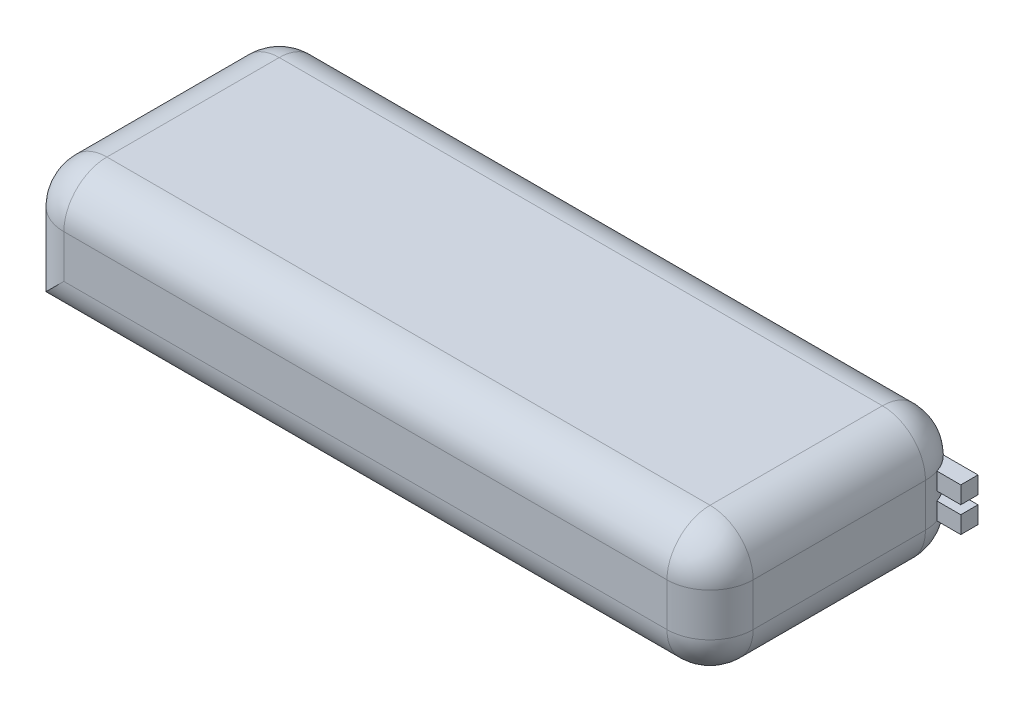
ISO-10303-21;
HEADER;
FILE_DESCRIPTION(('STEP AP214'),'2;1');
FILE_NAME('part.step','',(''),(''),'','','');
FILE_SCHEMA(('AUTOMOTIVE_DESIGN { 1 0 10303 214 1 1 1 1 }'));
ENDSEC;
DATA;
#1=APPLICATION_CONTEXT('core data for automotive mechanical design processes');
#2=APPLICATION_PROTOCOL_DEFINITION('international standard','automotive_design',2000,#1);
#3=PRODUCT_CONTEXT('',#1,'mechanical');
#4=PRODUCT('Part','Part','',(#3));
#5=PRODUCT_RELATED_PRODUCT_CATEGORY('part','',(#4));
#6=PRODUCT_DEFINITION_FORMATION('','',#4);
#7=PRODUCT_DEFINITION_CONTEXT('part definition',#1,'design');
#8=PRODUCT_DEFINITION('design','',#6,#7);
#9=PRODUCT_DEFINITION_SHAPE('','',#8);
#10=(LENGTH_UNIT() NAMED_UNIT(*) SI_UNIT(.MILLI.,.METRE.));
#11=(NAMED_UNIT(*) PLANE_ANGLE_UNIT() SI_UNIT($,.RADIAN.));
#12=(NAMED_UNIT(*) SI_UNIT($,.STERADIAN.) SOLID_ANGLE_UNIT());
#13=UNCERTAINTY_MEASURE_WITH_UNIT(LENGTH_MEASURE(1.E-05),#10,'distance_accuracy_value','');
#14=(GEOMETRIC_REPRESENTATION_CONTEXT(3) GLOBAL_UNCERTAINTY_ASSIGNED_CONTEXT((#13)) GLOBAL_UNIT_ASSIGNED_CONTEXT((#10,
#11,#12)) REPRESENTATION_CONTEXT('',''));
#15=CARTESIAN_POINT('',(0.,0.,0.));
#16=DIRECTION('',(0.,0.,1.));
#17=DIRECTION('',(1.,0.,0.));
#18=AXIS2_PLACEMENT_3D('',#15,#16,#17);
#19=CARTESIAN_POINT('',(85.,16.,-23.1922603152634));
#20=DIRECTION('',(0.,1.,0.));
#21=DIRECTION('',(0.,0.,1.));
#22=AXIS2_PLACEMENT_3D('',#19,#20,#21);
#23=PLANE('',#22);
#24=CARTESIAN_POINT('',(70.,16.,-20.));
#25=DIRECTION('',(0.,1.,0.));
#26=DIRECTION('',(0.,0.,1.));
#27=AXIS2_PLACEMENT_3D('',#24,#25,#26);
#28=CIRCLE('',#27,10.);
#29=CARTESIAN_POINT('',(76.9477616220972,16.,-27.1922603152634));
#30=VERTEX_POINT('',#29);
#31=CARTESIAN_POINT('',(79.4767860627744,16.,-23.1922603152634));
#32=VERTEX_POINT('',#31);
#33=EDGE_CURVE('E11',#30,#32,#28,.F.);
#34=ORIENTED_EDGE('',*,*,#33,.F.);
#35=DIRECTION('',(-1.,0.,0.));
#36=VECTOR('',#35,1.);
#37=CARTESIAN_POINT('',(85.,16.,-27.1922603152634));
#38=LINE('',#37,#36);
#39=CARTESIAN_POINT('',(85.,16.,-27.1922603152634));
#40=VERTEX_POINT('',#39);
#41=EDGE_CURVE('E208',#40,#30,#38,.T.);
#42=ORIENTED_EDGE('',*,*,#41,.F.);
#43=DIRECTION('',(0.,0.,-1.));
#44=VECTOR('',#43,1.);
#45=CARTESIAN_POINT('',(85.,16.,-23.1922603152634));
#46=LINE('',#45,#44);
#47=CARTESIAN_POINT('',(85.,16.,-23.1922603152634));
#48=VERTEX_POINT('',#47);
#49=EDGE_CURVE('E206',#48,#40,#46,.T.);
#50=ORIENTED_EDGE('',*,*,#49,.F.);
#51=DIRECTION('',(-1.,0.,0.));
#52=VECTOR('',#51,1.);
#53=CARTESIAN_POINT('',(85.,16.,-23.1922603152634));
#54=LINE('',#53,#52);
#55=EDGE_CURVE('E211',#48,#32,#54,.T.);
#56=ORIENTED_EDGE('',*,*,#55,.T.);
#57=EDGE_LOOP('',(#34,#42,#50,#56));
#58=FACE_BOUND('',#57,.T.);
#59=ADVANCED_FACE('F35',(#58),#23,.F.);
#60=CARTESIAN_POINT('',(85.,20.,-27.1922603152634));
#61=DIRECTION('',(0.,0.,1.));
#62=DIRECTION('',(1.,0.,0.));
#63=AXIS2_PLACEMENT_3D('',#60,#61,#62);
#64=PLANE('',#63);
#65=DIRECTION('',(0.,-1.,0.));
#66=VECTOR('',#65,1.);
#67=CARTESIAN_POINT('',(76.9477616220972,30.,-27.1922603152634));
#68=LINE('',#67,#66);
#69=CARTESIAN_POINT('',(76.9477616220972,20.,-27.1922603152634));
#70=VERTEX_POINT('',#69);
#71=EDGE_CURVE('E43',#70,#30,#68,.T.);
#72=ORIENTED_EDGE('',*,*,#71,.F.);
#73=DIRECTION('',(-1.,0.,0.));
#74=VECTOR('',#73,1.);
#75=CARTESIAN_POINT('',(85.,20.,-27.1922603152634));
#76=LINE('',#75,#74);
#77=CARTESIAN_POINT('',(85.,20.,-27.1922603152634));
#78=VERTEX_POINT('',#77);
#79=EDGE_CURVE('E216',#78,#70,#76,.T.);
#80=ORIENTED_EDGE('',*,*,#79,.F.);
#81=DIRECTION('',(0.,1.,0.));
#82=VECTOR('',#81,1.);
#83=CARTESIAN_POINT('',(85.,20.,-27.1922603152634));
#84=LINE('',#83,#82);
#85=EDGE_CURVE('E194',#40,#78,#84,.T.);
#86=ORIENTED_EDGE('',*,*,#85,.F.);
#87=ORIENTED_EDGE('',*,*,#41,.T.);
#88=EDGE_LOOP('',(#72,#80,#86,#87));
#89=FACE_BOUND('',#88,.T.);
#90=ADVANCED_FACE('F401',(#89),#64,.F.);
#91=CARTESIAN_POINT('',(85.,14.,-23.1922603152634));
#92=DIRECTION('',(0.,-1.,0.));
#93=DIRECTION('',(0.,0.,-1.));
#94=AXIS2_PLACEMENT_3D('',#91,#92,#93);
#95=PLANE('',#94);
#96=CARTESIAN_POINT('',(70.,14.,-20.));
#97=DIRECTION('',(0.,-1.,0.));
#98=DIRECTION('',(0.,0.,-1.));
#99=AXIS2_PLACEMENT_3D('',#96,#97,#98);
#100=CIRCLE('',#99,10.);
#101=CARTESIAN_POINT('',(79.4767860627744,14.,-23.1922603152634));
#102=VERTEX_POINT('',#101);
#103=CARTESIAN_POINT('',(76.9477616220972,14.,-27.1922603152634));
#104=VERTEX_POINT('',#103);
#105=EDGE_CURVE('E337',#102,#104,#100,.F.);
#106=ORIENTED_EDGE('',*,*,#105,.F.);
#107=DIRECTION('',(-1.,0.,0.));
#108=VECTOR('',#107,1.);
#109=CARTESIAN_POINT('',(85.,14.,-23.1922603152634));
#110=LINE('',#109,#108);
#111=CARTESIAN_POINT('',(85.,14.,-23.1922603152634));
#112=VERTEX_POINT('',#111);
#113=EDGE_CURVE('E173',#112,#102,#110,.T.);
#114=ORIENTED_EDGE('',*,*,#113,.F.);
#115=DIRECTION('',(0.,0.,1.));
#116=VECTOR('',#115,1.);
#117=CARTESIAN_POINT('',(85.,14.,-23.1922603152634));
#118=LINE('',#117,#116);
#119=CARTESIAN_POINT('',(85.,14.,-27.1922603152634));
#120=VERTEX_POINT('',#119);
#121=EDGE_CURVE('E166',#120,#112,#118,.T.);
#122=ORIENTED_EDGE('',*,*,#121,.F.);
#123=DIRECTION('',(-1.,0.,0.));
#124=VECTOR('',#123,1.);
#125=CARTESIAN_POINT('',(85.,14.,-27.1922603152634));
#126=LINE('',#125,#124);
#127=EDGE_CURVE('E171',#120,#104,#126,.T.);
#128=ORIENTED_EDGE('',*,*,#127,.T.);
#129=EDGE_LOOP('',(#106,#114,#122,#128));
#130=FACE_BOUND('',#129,.T.);
#131=ADVANCED_FACE('F169',(#130),#95,.F.);
#132=CARTESIAN_POINT('',(85.,10.,-23.1922603152634));
#133=DIRECTION('',(0.,0.,-1.));
#134=DIRECTION('',(-1.,0.,0.));
#135=AXIS2_PLACEMENT_3D('',#132,#133,#134);
#136=PLANE('',#135);
#137=DIRECTION('',(0.,-1.,0.));
#138=VECTOR('',#137,1.);
#139=CARTESIAN_POINT('',(79.4767860627744,30.,-23.1922603152634));
#140=LINE('',#139,#138);
#141=CARTESIAN_POINT('',(79.4767860627744,10.,-23.1922603152634));
#142=VERTEX_POINT('',#141);
#143=EDGE_CURVE('E335',#142,#102,#140,.F.);
#144=ORIENTED_EDGE('',*,*,#143,.F.);
#145=DIRECTION('',(-1.,0.,0.));
#146=VECTOR('',#145,1.);
#147=CARTESIAN_POINT('',(85.,10.,-23.1922603152634));
#148=LINE('',#147,#146);
#149=CARTESIAN_POINT('',(85.,10.,-23.1922603152634));
#150=VERTEX_POINT('',#149);
#151=EDGE_CURVE('E196',#150,#142,#148,.T.);
#152=ORIENTED_EDGE('',*,*,#151,.F.);
#153=DIRECTION('',(0.,-1.,0.));
#154=VECTOR('',#153,1.);
#155=CARTESIAN_POINT('',(85.,10.,-23.1922603152634));
#156=LINE('',#155,#154);
#157=EDGE_CURVE('E176',#112,#150,#156,.T.);
#158=ORIENTED_EDGE('',*,*,#157,.F.);
#159=ORIENTED_EDGE('',*,*,#113,.T.);
#160=EDGE_LOOP('',(#144,#152,#158,#159));
#161=FACE_BOUND('',#160,.T.);
#162=ADVANCED_FACE('F436',(#161),#136,.F.);
#163=CARTESIAN_POINT('',(80.,30.,30.));
#164=DIRECTION('',(-1.,0.,0.));
#165=DIRECTION('',(0.,0.,1.));
#166=AXIS2_PLACEMENT_3D('',#163,#164,#165);
#167=PLANE('',#166);
#168=DIRECTION('',(0.,0.,-1.));
#169=VECTOR('',#168,1.);
#170=CARTESIAN_POINT('',(80.,10.,-30.));
#171=LINE('',#170,#169);
#172=CARTESIAN_POINT('',(80.,10.,20.));
#173=VERTEX_POINT('',#172);
#174=CARTESIAN_POINT('',(80.,10.,-20.));
#175=VERTEX_POINT('',#174);
#176=EDGE_CURVE('E258',#173,#175,#171,.T.);
#177=ORIENTED_EDGE('',*,*,#176,.T.);
#178=DIRECTION('',(0.,-1.,0.));
#179=VECTOR('',#178,1.);
#180=CARTESIAN_POINT('',(80.,30.,-20.));
#181=LINE('',#180,#179);
#182=CARTESIAN_POINT('',(80.,20.,-20.));
#183=VERTEX_POINT('',#182);
#184=EDGE_CURVE('E261',#175,#183,#181,.F.);
#185=ORIENTED_EDGE('',*,*,#184,.T.);
#186=DIRECTION('',(0.,0.,-1.));
#187=VECTOR('',#186,1.);
#188=CARTESIAN_POINT('',(80.,20.,30.));
#189=LINE('',#188,#187);
#190=CARTESIAN_POINT('',(80.,20.,20.));
#191=VERTEX_POINT('',#190);
#192=EDGE_CURVE('E256',#183,#191,#189,.F.);
#193=ORIENTED_EDGE('',*,*,#192,.T.);
#194=DIRECTION('',(0.,-1.,0.));
#195=VECTOR('',#194,1.);
#196=CARTESIAN_POINT('',(80.,30.,20.));
#197=LINE('',#196,#195);
#198=EDGE_CURVE('E254',#191,#173,#197,.T.);
#199=ORIENTED_EDGE('',*,*,#198,.T.);
#200=EDGE_LOOP('',(#177,#185,#193,#199));
#201=FACE_BOUND('',#200,.T.);
#202=ADVANCED_FACE('F432',(#201),#167,.F.);
#203=CARTESIAN_POINT('',(-80.,30.,-30.));
#204=DIRECTION('',(0.,0.,1.));
#205=DIRECTION('',(1.,0.,0.));
#206=AXIS2_PLACEMENT_3D('',#203,#204,#205);
#207=PLANE('',#206);
#208=DIRECTION('',(-1.,0.,0.));
#209=VECTOR('',#208,1.);
#210=CARTESIAN_POINT('',(-80.,10.,-30.));
#211=LINE('',#210,#209);
#212=CARTESIAN_POINT('',(70.,10.,-30.));
#213=VERTEX_POINT('',#212);
#214=CARTESIAN_POINT('',(-70.,10.,-30.));
#215=VERTEX_POINT('',#214);
#216=EDGE_CURVE('E243',#213,#215,#211,.T.);
#217=ORIENTED_EDGE('',*,*,#216,.T.);
#218=DIRECTION('',(0.,-1.,0.));
#219=VECTOR('',#218,1.);
#220=CARTESIAN_POINT('',(-70.,30.,-30.));
#221=LINE('',#220,#219);
#222=CARTESIAN_POINT('',(-70.,20.,-30.));
#223=VERTEX_POINT('',#222);
#224=EDGE_CURVE('E245',#215,#223,#221,.F.);
#225=ORIENTED_EDGE('',*,*,#224,.T.);
#226=DIRECTION('',(-1.,0.,0.));
#227=VECTOR('',#226,1.);
#228=CARTESIAN_POINT('',(-80.,20.,-30.));
#229=LINE('',#228,#227);
#230=CARTESIAN_POINT('',(70.,20.,-30.));
#231=VERTEX_POINT('',#230);
#232=EDGE_CURVE('E238',#223,#231,#229,.F.);
#233=ORIENTED_EDGE('',*,*,#232,.T.);
#234=DIRECTION('',(0.,-1.,0.));
#235=VECTOR('',#234,1.);
#236=CARTESIAN_POINT('',(70.,30.,-30.));
#237=LINE('',#236,#235);
#238=EDGE_CURVE('E241',#231,#213,#237,.T.);
#239=ORIENTED_EDGE('',*,*,#238,.T.);
#240=EDGE_LOOP('',(#217,#225,#233,#239));
#241=FACE_BOUND('',#240,.T.);
#242=ADVANCED_FACE('F428',(#241),#207,.F.);
#243=CARTESIAN_POINT('',(-80.,30.,30.));
#244=DIRECTION('',(1.,0.,0.));
#245=DIRECTION('',(0.,0.,-1.));
#246=AXIS2_PLACEMENT_3D('',#243,#244,#245);
#247=PLANE('',#246);
#248=DIRECTION('',(0.,0.,1.));
#249=VECTOR('',#248,1.);
#250=CARTESIAN_POINT('',(-80.,0.,30.));
#251=LINE('',#250,#249);
#252=CARTESIAN_POINT('',(-80.,0.,-20.));
#253=VERTEX_POINT('',#252);
#254=CARTESIAN_POINT('',(-80.,0.,20.));
#255=VERTEX_POINT('',#254);
#256=EDGE_CURVE('E219',#253,#255,#251,.T.);
#257=ORIENTED_EDGE('',*,*,#256,.T.);
#258=DIRECTION('',(0.,-1.,0.));
#259=VECTOR('',#258,1.);
#260=CARTESIAN_POINT('',(-80.,30.,20.));
#261=LINE('',#260,#259);
#262=CARTESIAN_POINT('',(-80.,20.,20.));
#263=VERTEX_POINT('',#262);
#264=EDGE_CURVE('E235',#255,#263,#261,.F.);
#265=ORIENTED_EDGE('',*,*,#264,.T.);
#266=DIRECTION('',(0.,0.,1.));
#267=VECTOR('',#266,1.);
#268=CARTESIAN_POINT('',(-80.,20.,30.));
#269=LINE('',#268,#267);
#270=CARTESIAN_POINT('',(-80.,20.,-20.));
#271=VERTEX_POINT('',#270);
#272=EDGE_CURVE('E231',#263,#271,#269,.F.);
#273=ORIENTED_EDGE('',*,*,#272,.T.);
#274=DIRECTION('',(0.,-1.,0.));
#275=VECTOR('',#274,1.);
#276=CARTESIAN_POINT('',(-80.,30.,-20.));
#277=LINE('',#276,#275);
#278=EDGE_CURVE('E233',#271,#253,#277,.T.);
#279=ORIENTED_EDGE('',*,*,#278,.T.);
#280=EDGE_LOOP('',(#257,#265,#273,#279));
#281=FACE_BOUND('',#280,.T.);
#282=ADVANCED_FACE('F425',(#281),#247,.F.);
#283=CARTESIAN_POINT('',(-80.,30.,30.));
#284=DIRECTION('',(0.,0.,-1.));
#285=DIRECTION('',(-1.,0.,0.));
#286=AXIS2_PLACEMENT_3D('',#283,#284,#285);
#287=PLANE('',#286);
#288=DIRECTION('',(0.,-1.,0.));
#289=VECTOR('',#288,1.);
#290=CARTESIAN_POINT('',(-70.,30.,30.));
#291=LINE('',#290,#289);
#292=CARTESIAN_POINT('',(-70.,20.,30.));
#293=VERTEX_POINT('',#292);
#294=CARTESIAN_POINT('',(-70.,10.,30.));
#295=VERTEX_POINT('',#294);
#296=EDGE_CURVE('E226',#293,#295,#291,.T.);
#297=ORIENTED_EDGE('',*,*,#296,.T.);
#298=DIRECTION('',(1.,0.,0.));
#299=VECTOR('',#298,1.);
#300=CARTESIAN_POINT('',(80.,10.,30.));
#301=LINE('',#300,#299);
#302=CARTESIAN_POINT('',(70.,10.,30.));
#303=VERTEX_POINT('',#302);
#304=EDGE_CURVE('E229',#295,#303,#301,.T.);
#305=ORIENTED_EDGE('',*,*,#304,.T.);
#306=DIRECTION('',(0.,-1.,0.));
#307=VECTOR('',#306,1.);
#308=CARTESIAN_POINT('',(70.,30.,30.));
#309=LINE('',#308,#307);
#310=CARTESIAN_POINT('',(70.,20.,30.));
#311=VERTEX_POINT('',#310);
#312=EDGE_CURVE('E224',#303,#311,#309,.F.);
#313=ORIENTED_EDGE('',*,*,#312,.T.);
#314=DIRECTION('',(1.,0.,0.));
#315=VECTOR('',#314,1.);
#316=CARTESIAN_POINT('',(-80.,20.,30.));
#317=LINE('',#316,#315);
#318=EDGE_CURVE('E222',#311,#293,#317,.F.);
#319=ORIENTED_EDGE('',*,*,#318,.T.);
#320=EDGE_LOOP('',(#297,#305,#313,#319));
#321=FACE_BOUND('',#320,.T.);
#322=ADVANCED_FACE('F379',(#321),#287,.F.);
#323=CARTESIAN_POINT('',(0.,30.,0.));
#324=DIRECTION('',(0.,-1.,0.));
#325=DIRECTION('',(0.,0.,-1.));
#326=AXIS2_PLACEMENT_3D('',#323,#324,#325);
#327=PLANE('',#326);
#328=DIRECTION('',(0.,0.,-1.));
#329=VECTOR('',#328,1.);
#330=CARTESIAN_POINT('',(70.,30.,0.));
#331=LINE('',#330,#329);
#332=CARTESIAN_POINT('',(70.,30.,20.));
#333=VERTEX_POINT('',#332);
#334=CARTESIAN_POINT('',(70.,30.,-20.));
#335=VERTEX_POINT('',#334);
#336=EDGE_CURVE('E268',#333,#335,#331,.T.);
#337=ORIENTED_EDGE('',*,*,#336,.T.);
#338=DIRECTION('',(-1.,0.,0.));
#339=VECTOR('',#338,1.);
#340=CARTESIAN_POINT('',(0.,30.,-20.));
#341=LINE('',#340,#339);
#342=CARTESIAN_POINT('',(-70.,30.,-20.));
#343=VERTEX_POINT('',#342);
#344=EDGE_CURVE('E271',#335,#343,#341,.T.);
#345=ORIENTED_EDGE('',*,*,#344,.T.);
#346=DIRECTION('',(0.,0.,1.));
#347=VECTOR('',#346,1.);
#348=CARTESIAN_POINT('',(-70.,30.,0.));
#349=LINE('',#348,#347);
#350=CARTESIAN_POINT('',(-70.,30.,20.));
#351=VERTEX_POINT('',#350);
#352=EDGE_CURVE('E266',#343,#351,#349,.T.);
#353=ORIENTED_EDGE('',*,*,#352,.T.);
#354=DIRECTION('',(1.,0.,0.));
#355=VECTOR('',#354,1.);
#356=CARTESIAN_POINT('',(0.,30.,20.));
#357=LINE('',#356,#355);
#358=EDGE_CURVE('E264',#351,#333,#357,.T.);
#359=ORIENTED_EDGE('',*,*,#358,.T.);
#360=EDGE_LOOP('',(#337,#345,#353,#359));
#361=FACE_BOUND('',#360,.T.);
#362=ADVANCED_FACE('F356',(#361),#327,.F.);
#363=CARTESIAN_POINT('',(0.,0.,0.));
#364=DIRECTION('',(0.,-1.,0.));
#365=DIRECTION('',(0.,0.,-1.));
#366=AXIS2_PLACEMENT_3D('',#363,#364,#365);
#367=PLANE('',#366);
#368=ORIENTED_EDGE('',*,*,#256,.F.);
#369=DIRECTION('',(-1.,0.,0.));
#370=VECTOR('',#369,1.);
#371=CARTESIAN_POINT('',(80.,0.,-20.));
#372=LINE('',#371,#370);
#373=CARTESIAN_POINT('',(70.,0.,-20.));
#374=VERTEX_POINT('',#373);
#375=EDGE_CURVE('E252',#253,#374,#372,.F.);
#376=ORIENTED_EDGE('',*,*,#375,.T.);
#377=DIRECTION('',(0.,0.,-1.));
#378=VECTOR('',#377,1.);
#379=CARTESIAN_POINT('',(70.,0.,30.));
#380=LINE('',#379,#378);
#381=CARTESIAN_POINT('',(70.,0.,20.));
#382=VERTEX_POINT('',#381);
#383=EDGE_CURVE('E250',#374,#382,#380,.F.);
#384=ORIENTED_EDGE('',*,*,#383,.T.);
#385=DIRECTION('',(1.,0.,0.));
#386=VECTOR('',#385,1.);
#387=CARTESIAN_POINT('',(-80.,0.,20.));
#388=LINE('',#387,#386);
#389=EDGE_CURVE('E248',#382,#255,#388,.F.);
#390=ORIENTED_EDGE('',*,*,#389,.T.);
#391=EDGE_LOOP('',(#368,#376,#384,#390));
#392=FACE_BOUND('',#391,.T.);
#393=ADVANCED_FACE('F416',(#392),#367,.T.);
#394=CARTESIAN_POINT('',(85.,20.,-23.1922603152634));
#395=DIRECTION('',(0.,-1.,0.));
#396=DIRECTION('',(0.,0.,-1.));
#397=AXIS2_PLACEMENT_3D('',#394,#395,#396);
#398=PLANE('',#397);
#399=CARTESIAN_POINT('',(70.,20.,-20.));
#400=DIRECTION('',(0.,-1.,0.));
#401=DIRECTION('',(0.,0.,-1.));
#402=AXIS2_PLACEMENT_3D('',#399,#400,#401);
#403=CIRCLE('',#402,10.);
#404=CARTESIAN_POINT('',(79.4767860627744,20.,-23.1922603152634));
#405=VERTEX_POINT('',#404);
#406=EDGE_CURVE('E191',#70,#405,#403,.T.);
#407=ORIENTED_EDGE('',*,*,#406,.T.);
#408=DIRECTION('',(-1.,0.,0.));
#409=VECTOR('',#408,1.);
#410=CARTESIAN_POINT('',(85.,20.,-23.1922603152634));
#411=LINE('',#410,#409);
#412=CARTESIAN_POINT('',(85.,20.,-23.1922603152634));
#413=VERTEX_POINT('',#412);
#414=EDGE_CURVE('E214',#413,#405,#411,.T.);
#415=ORIENTED_EDGE('',*,*,#414,.F.);
#416=DIRECTION('',(0.,0.,1.));
#417=VECTOR('',#416,1.);
#418=CARTESIAN_POINT('',(85.,20.,-23.1922603152634));
#419=LINE('',#418,#417);
#420=EDGE_CURVE('E202',#78,#413,#419,.T.);
#421=ORIENTED_EDGE('',*,*,#420,.F.);
#422=ORIENTED_EDGE('',*,*,#79,.T.);
#423=EDGE_LOOP('',(#407,#415,#421,#422));
#424=FACE_BOUND('',#423,.T.);
#425=ADVANCED_FACE('F344',(#424),#398,.F.);
#426=CARTESIAN_POINT('',(85.,20.,-23.1922603152634));
#427=DIRECTION('',(0.,0.,-1.));
#428=DIRECTION('',(-1.,0.,0.));
#429=AXIS2_PLACEMENT_3D('',#426,#427,#428);
#430=PLANE('',#429);
#431=DIRECTION('',(0.,-1.,0.));
#432=VECTOR('',#431,1.);
#433=CARTESIAN_POINT('',(79.4767860627744,30.,-23.1922603152634));
#434=LINE('',#433,#432);
#435=EDGE_CURVE('E56',#32,#405,#434,.F.);
#436=ORIENTED_EDGE('',*,*,#435,.F.);
#437=ORIENTED_EDGE('',*,*,#55,.F.);
#438=DIRECTION('',(0.,-1.,0.));
#439=VECTOR('',#438,1.);
#440=CARTESIAN_POINT('',(85.,20.,-23.1922603152634));
#441=LINE('',#440,#439);
#442=EDGE_CURVE('E204',#413,#48,#441,.T.);
#443=ORIENTED_EDGE('',*,*,#442,.F.);
#444=ORIENTED_EDGE('',*,*,#414,.T.);
#445=EDGE_LOOP('',(#436,#437,#443,#444));
#446=FACE_BOUND('',#445,.T.);
#447=ADVANCED_FACE('F348',(#446),#430,.F.);
#448=CARTESIAN_POINT('',(85.,0.,0.));
#449=DIRECTION('',(1.,0.,0.));
#450=DIRECTION('',(0.,0.,-1.));
#451=AXIS2_PLACEMENT_3D('',#448,#449,#450);
#452=PLANE('',#451);
#453=ORIENTED_EDGE('',*,*,#85,.T.);
#454=ORIENTED_EDGE('',*,*,#420,.T.);
#455=ORIENTED_EDGE('',*,*,#442,.T.);
#456=ORIENTED_EDGE('',*,*,#49,.T.);
#457=EDGE_LOOP('',(#453,#454,#455,#456));
#458=FACE_BOUND('',#457,.T.);
#459=ADVANCED_FACE('F411',(#458),#452,.T.);
#460=CARTESIAN_POINT('',(85.,10.,-27.1922603152634));
#461=DIRECTION('',(0.,0.,1.));
#462=DIRECTION('',(1.,0.,0.));
#463=AXIS2_PLACEMENT_3D('',#460,#461,#462);
#464=PLANE('',#463);
#465=DIRECTION('',(0.,-1.,0.));
#466=VECTOR('',#465,1.);
#467=CARTESIAN_POINT('',(76.9477616220972,30.,-27.1922603152634));
#468=LINE('',#467,#466);
#469=CARTESIAN_POINT('',(76.9477616220972,10.,-27.1922603152634));
#470=VERTEX_POINT('',#469);
#471=EDGE_CURVE('E189',#104,#470,#468,.T.);
#472=ORIENTED_EDGE('',*,*,#471,.F.);
#473=ORIENTED_EDGE('',*,*,#127,.F.);
#474=DIRECTION('',(0.,1.,0.));
#475=VECTOR('',#474,1.);
#476=CARTESIAN_POINT('',(85.,10.,-27.1922603152634));
#477=LINE('',#476,#475);
#478=CARTESIAN_POINT('',(85.,10.,-27.1922603152634));
#479=VERTEX_POINT('',#478);
#480=EDGE_CURVE('E177',#479,#120,#477,.T.);
#481=ORIENTED_EDGE('',*,*,#480,.F.);
#482=DIRECTION('',(-1.,0.,0.));
#483=VECTOR('',#482,1.);
#484=CARTESIAN_POINT('',(85.,10.,-27.1922603152634));
#485=LINE('',#484,#483);
#486=EDGE_CURVE('E471',#479,#470,#485,.T.);
#487=ORIENTED_EDGE('',*,*,#486,.T.);
#488=EDGE_LOOP('',(#472,#473,#481,#487));
#489=FACE_BOUND('',#488,.T.);
#490=ADVANCED_FACE('F188',(#489),#464,.F.);
#491=CARTESIAN_POINT('',(85.,10.,-23.1922603152634));
#492=DIRECTION('',(0.,1.,0.));
#493=DIRECTION('',(0.,0.,1.));
#494=AXIS2_PLACEMENT_3D('',#491,#492,#493);
#495=PLANE('',#494);
#496=CARTESIAN_POINT('',(70.,10.,-20.));
#497=DIRECTION('',(0.,1.,0.));
#498=DIRECTION('',(0.,0.,1.));
#499=AXIS2_PLACEMENT_3D('',#496,#497,#498);
#500=CIRCLE('',#499,10.);
#501=EDGE_CURVE('E186',#142,#470,#500,.T.);
#502=ORIENTED_EDGE('',*,*,#501,.T.);
#503=ORIENTED_EDGE('',*,*,#486,.F.);
#504=DIRECTION('',(0.,0.,-1.));
#505=VECTOR('',#504,1.);
#506=CARTESIAN_POINT('',(85.,10.,-23.1922603152634));
#507=LINE('',#506,#505);
#508=EDGE_CURVE('E182',#150,#479,#507,.T.);
#509=ORIENTED_EDGE('',*,*,#508,.F.);
#510=ORIENTED_EDGE('',*,*,#151,.T.);
#511=EDGE_LOOP('',(#502,#503,#509,#510));
#512=FACE_BOUND('',#511,.T.);
#513=ADVANCED_FACE('F469',(#512),#495,.F.);
#514=CARTESIAN_POINT('',(85.,0.,0.));
#515=DIRECTION('',(-1.,0.,0.));
#516=DIRECTION('',(0.,0.,1.));
#517=AXIS2_PLACEMENT_3D('',#514,#515,#516);
#518=PLANE('',#517);
#519=ORIENTED_EDGE('',*,*,#480,.T.);
#520=ORIENTED_EDGE('',*,*,#121,.T.);
#521=ORIENTED_EDGE('',*,*,#157,.T.);
#522=ORIENTED_EDGE('',*,*,#508,.T.);
#523=EDGE_LOOP('',(#519,#520,#521,#522));
#524=FACE_BOUND('',#523,.T.);
#525=ADVANCED_FACE('F180',(#524),#518,.F.);
#526=CARTESIAN_POINT('',(70.,20.,-20.));
#527=DIRECTION('',(0.,0.,1.));
#528=DIRECTION('',(1.,0.,0.));
#529=AXIS2_PLACEMENT_3D('',#526,#527,#528);
#530=SPHERICAL_SURFACE('',#529,10.);
#531=ORIENTED_EDGE('',*,*,#406,.F.);
#532=CARTESIAN_POINT('',(70.,20.,-20.));
#533=DIRECTION('',(0.,1.,0.));
#534=DIRECTION('',(0.,0.,1.));
#535=AXIS2_PLACEMENT_3D('',#532,#533,#534);
#536=CIRCLE('',#535,10.);
#537=EDGE_CURVE('E328',#231,#70,#536,.F.);
#538=ORIENTED_EDGE('',*,*,#537,.F.);
#539=CARTESIAN_POINT('',(70.,20.,-20.));
#540=DIRECTION('',(1.,0.,0.));
#541=DIRECTION('',(0.,1.,0.));
#542=AXIS2_PLACEMENT_3D('',#539,#540,#541);
#543=CIRCLE('',#542,10.);
#544=EDGE_CURVE('E322',#335,#231,#543,.F.);
#545=ORIENTED_EDGE('',*,*,#544,.F.);
#546=CARTESIAN_POINT('',(70.,20.,-20.));
#547=DIRECTION('',(0.,0.,-1.));
#548=DIRECTION('',(-1.,0.,0.));
#549=AXIS2_PLACEMENT_3D('',#546,#547,#548);
#550=CIRCLE('',#549,10.);
#551=EDGE_CURVE('E319',#183,#335,#550,.F.);
#552=ORIENTED_EDGE('',*,*,#551,.F.);
#553=EDGE_CURVE('E329',#405,#183,#536,.F.);
#554=ORIENTED_EDGE('',*,*,#553,.F.);
#555=EDGE_LOOP('',(#531,#538,#545,#552,#554));
#556=FACE_BOUND('',#555,.T.);
#557=ADVANCED_FACE('F37',(#556),#530,.T.);
#558=CARTESIAN_POINT('',(70.,30.,-20.));
#559=DIRECTION('',(0.,-1.,0.));
#560=DIRECTION('',(0.,0.,-1.));
#561=AXIS2_PLACEMENT_3D('',#558,#559,#560);
#562=CYLINDRICAL_SURFACE('',#561,10.);
#563=ORIENTED_EDGE('',*,*,#71,.T.);
#564=ORIENTED_EDGE('',*,*,#33,.T.);
#565=ORIENTED_EDGE('',*,*,#435,.T.);
#566=ORIENTED_EDGE('',*,*,#553,.T.);
#567=ORIENTED_EDGE('',*,*,#184,.F.);
#568=CARTESIAN_POINT('',(70.,10.,-20.));
#569=DIRECTION('',(0.,-1.,0.));
#570=DIRECTION('',(0.,0.,-1.));
#571=AXIS2_PLACEMENT_3D('',#568,#569,#570);
#572=CIRCLE('',#571,10.);
#573=EDGE_CURVE('E315',#142,#175,#572,.T.);
#574=ORIENTED_EDGE('',*,*,#573,.F.);
#575=ORIENTED_EDGE('',*,*,#143,.T.);
#576=ORIENTED_EDGE('',*,*,#105,.T.);
#577=ORIENTED_EDGE('',*,*,#471,.T.);
#578=EDGE_CURVE('E316',#213,#470,#572,.T.);
#579=ORIENTED_EDGE('',*,*,#578,.F.);
#580=ORIENTED_EDGE('',*,*,#238,.F.);
#581=ORIENTED_EDGE('',*,*,#537,.T.);
#582=EDGE_LOOP('',(#563,#564,#565,#566,#567,#574,#575,#576,#577,#579,#580,#581));
#583=FACE_BOUND('',#582,.T.);
#584=ADVANCED_FACE('F339',(#583),#562,.T.);
#585=CARTESIAN_POINT('',(-80.,10.,-20.));
#586=DIRECTION('',(1.,0.,0.));
#587=DIRECTION('',(0.,0.,-1.));
#588=AXIS2_PLACEMENT_3D('',#585,#586,#587);
#589=CYLINDRICAL_SURFACE('',#588,10.);
#590=CARTESIAN_POINT('',(70.,10.,-20.));
#591=DIRECTION('',(1.,0.,0.));
#592=DIRECTION('',(0.,0.,-1.));
#593=AXIS2_PLACEMENT_3D('',#590,#591,#592);
#594=CIRCLE('',#593,10.);
#595=EDGE_CURVE('E312',#374,#213,#594,.T.);
#596=ORIENTED_EDGE('',*,*,#595,.F.);
#597=ORIENTED_EDGE('',*,*,#375,.F.);
#598=CARTESIAN_POINT('',(-70.,10.,-20.));
#599=DIRECTION('',(0.707106781186547,-0.707106781186547,0.));
#600=DIRECTION('',(0.707106781186547,0.707106781186547,0.));
#601=AXIS2_PLACEMENT_3D('',#598,#599,#600);
#602=ELLIPSE('',#601,14.1421356237309,10.);
#603=EDGE_CURVE('E325',#215,#253,#602,.F.);
#604=ORIENTED_EDGE('',*,*,#603,.F.);
#605=ORIENTED_EDGE('',*,*,#216,.F.);
#606=EDGE_LOOP('',(#596,#597,#604,#605));
#607=FACE_BOUND('',#606,.T.);
#608=ADVANCED_FACE('F511',(#607),#589,.T.);
#609=CARTESIAN_POINT('',(-70.,30.,-20.));
#610=DIRECTION('',(0.,-1.,0.));
#611=DIRECTION('',(0.,0.,-1.));
#612=AXIS2_PLACEMENT_3D('',#609,#610,#611);
#613=CYLINDRICAL_SURFACE('',#612,10.);
#614=ORIENTED_EDGE('',*,*,#603,.T.);
#615=ORIENTED_EDGE('',*,*,#278,.F.);
#616=CARTESIAN_POINT('',(-70.,20.,-20.));
#617=DIRECTION('',(0.,1.,0.));
#618=DIRECTION('',(0.,0.,1.));
#619=AXIS2_PLACEMENT_3D('',#616,#617,#618);
#620=CIRCLE('',#619,10.);
#621=EDGE_CURVE('E309',#223,#271,#620,.T.);
#622=ORIENTED_EDGE('',*,*,#621,.F.);
#623=ORIENTED_EDGE('',*,*,#224,.F.);
#624=EDGE_LOOP('',(#614,#615,#622,#623));
#625=FACE_BOUND('',#624,.T.);
#626=ADVANCED_FACE('F505',(#625),#613,.T.);
#627=CARTESIAN_POINT('',(0.,20.,-20.));
#628=DIRECTION('',(-1.,0.,0.));
#629=DIRECTION('',(0.,0.,1.));
#630=AXIS2_PLACEMENT_3D('',#627,#628,#629);
#631=CYLINDRICAL_SURFACE('',#630,10.);
#632=ORIENTED_EDGE('',*,*,#544,.T.);
#633=ORIENTED_EDGE('',*,*,#232,.F.);
#634=CARTESIAN_POINT('',(-70.,20.,-20.));
#635=DIRECTION('',(-1.,0.,0.));
#636=DIRECTION('',(0.,0.,1.));
#637=AXIS2_PLACEMENT_3D('',#634,#635,#636);
#638=CIRCLE('',#637,10.);
#639=EDGE_CURVE('E307',#343,#223,#638,.T.);
#640=ORIENTED_EDGE('',*,*,#639,.F.);
#641=ORIENTED_EDGE('',*,*,#344,.F.);
#642=EDGE_LOOP('',(#632,#633,#640,#641));
#643=FACE_BOUND('',#642,.T.);
#644=ADVANCED_FACE('F500',(#643),#631,.T.);
#645=CARTESIAN_POINT('',(70.,20.,0.));
#646=DIRECTION('',(0.,0.,-1.));
#647=DIRECTION('',(-1.,0.,0.));
#648=AXIS2_PLACEMENT_3D('',#645,#646,#647);
#649=CYLINDRICAL_SURFACE('',#648,10.);
#650=ORIENTED_EDGE('',*,*,#551,.T.);
#651=ORIENTED_EDGE('',*,*,#336,.F.);
#652=CARTESIAN_POINT('',(70.,20.,20.));
#653=DIRECTION('',(0.,0.,1.));
#654=DIRECTION('',(1.,0.,0.));
#655=AXIS2_PLACEMENT_3D('',#652,#653,#654);
#656=CIRCLE('',#655,10.);
#657=EDGE_CURVE('E304',#191,#333,#656,.T.);
#658=ORIENTED_EDGE('',*,*,#657,.F.);
#659=ORIENTED_EDGE('',*,*,#192,.F.);
#660=EDGE_LOOP('',(#650,#651,#658,#659));
#661=FACE_BOUND('',#660,.T.);
#662=ADVANCED_FACE('F353',(#661),#649,.T.);
#663=CARTESIAN_POINT('',(70.,10.,-20.));
#664=DIRECTION('',(0.,0.,1.));
#665=DIRECTION('',(1.,0.,0.));
#666=AXIS2_PLACEMENT_3D('',#663,#664,#665);
#667=SPHERICAL_SURFACE('',#666,10.);
#668=ORIENTED_EDGE('',*,*,#501,.F.);
#669=ORIENTED_EDGE('',*,*,#573,.T.);
#670=CARTESIAN_POINT('',(70.,10.,-20.));
#671=DIRECTION('',(0.,0.,-1.));
#672=DIRECTION('',(-1.,0.,0.));
#673=AXIS2_PLACEMENT_3D('',#670,#671,#672);
#674=CIRCLE('',#673,10.);
#675=EDGE_CURVE('E298',#374,#175,#674,.F.);
#676=ORIENTED_EDGE('',*,*,#675,.F.);
#677=ORIENTED_EDGE('',*,*,#595,.T.);
#678=ORIENTED_EDGE('',*,*,#578,.T.);
#679=EDGE_LOOP('',(#668,#669,#676,#677,#678));
#680=FACE_BOUND('',#679,.T.);
#681=ADVANCED_FACE('F397',(#680),#667,.T.);
#682=CARTESIAN_POINT('',(-70.,20.,-20.));
#683=DIRECTION('',(0.,0.,1.));
#684=DIRECTION('',(1.,0.,0.));
#685=AXIS2_PLACEMENT_3D('',#682,#683,#684);
#686=SPHERICAL_SURFACE('',#685,10.);
#687=ORIENTED_EDGE('',*,*,#639,.T.);
#688=ORIENTED_EDGE('',*,*,#621,.T.);
#689=CARTESIAN_POINT('',(-70.,20.,-20.));
#690=DIRECTION('',(0.,0.,-1.));
#691=DIRECTION('',(-1.,0.,0.));
#692=AXIS2_PLACEMENT_3D('',#689,#690,#691);
#693=CIRCLE('',#692,10.);
#694=EDGE_CURVE('E295',#343,#271,#693,.F.);
#695=ORIENTED_EDGE('',*,*,#694,.F.);
#696=EDGE_LOOP('',(#687,#688,#695));
#697=FACE_BOUND('',#696,.T.);
#698=ADVANCED_FACE('F389',(#697),#686,.T.);
#699=CARTESIAN_POINT('',(70.,20.,20.));
#700=DIRECTION('',(0.,0.,1.));
#701=DIRECTION('',(1.,0.,0.));
#702=AXIS2_PLACEMENT_3D('',#699,#700,#701);
#703=SPHERICAL_SURFACE('',#702,10.);
#704=CARTESIAN_POINT('',(70.,20.,20.));
#705=DIRECTION('',(1.,0.,0.));
#706=DIRECTION('',(0.,0.,-1.));
#707=AXIS2_PLACEMENT_3D('',#704,#705,#706);
#708=CIRCLE('',#707,10.);
#709=EDGE_CURVE('E292',#311,#333,#708,.F.);
#710=ORIENTED_EDGE('',*,*,#709,.F.);
#711=CARTESIAN_POINT('',(70.,20.,20.));
#712=DIRECTION('',(0.,1.,0.));
#713=DIRECTION('',(0.,0.,1.));
#714=AXIS2_PLACEMENT_3D('',#711,#712,#713);
#715=CIRCLE('',#714,10.);
#716=EDGE_CURVE('E301',#191,#311,#715,.F.);
#717=ORIENTED_EDGE('',*,*,#716,.F.);
#718=ORIENTED_EDGE('',*,*,#657,.T.);
#719=EDGE_LOOP('',(#710,#717,#718));
#720=FACE_BOUND('',#719,.T.);
#721=ADVANCED_FACE('F387',(#720),#703,.T.);
#722=CARTESIAN_POINT('',(70.,30.,20.));
#723=DIRECTION('',(0.,-1.,0.));
#724=DIRECTION('',(0.,0.,-1.));
#725=AXIS2_PLACEMENT_3D('',#722,#723,#724);
#726=CYLINDRICAL_SURFACE('',#725,10.);
#727=ORIENTED_EDGE('',*,*,#716,.T.);
#728=ORIENTED_EDGE('',*,*,#312,.F.);
#729=CARTESIAN_POINT('',(70.,10.,20.));
#730=DIRECTION('',(0.,-1.,0.));
#731=DIRECTION('',(0.,0.,-1.));
#732=AXIS2_PLACEMENT_3D('',#729,#730,#731);
#733=CIRCLE('',#732,10.);
#734=EDGE_CURVE('E289',#173,#303,#733,.T.);
#735=ORIENTED_EDGE('',*,*,#734,.F.);
#736=ORIENTED_EDGE('',*,*,#198,.F.);
#737=EDGE_LOOP('',(#727,#728,#735,#736));
#738=FACE_BOUND('',#737,.T.);
#739=ADVANCED_FACE('F385',(#738),#726,.T.);
#740=CARTESIAN_POINT('',(70.,10.,30.));
#741=DIRECTION('',(0.,0.,1.));
#742=DIRECTION('',(1.,0.,0.));
#743=AXIS2_PLACEMENT_3D('',#740,#741,#742);
#744=CYLINDRICAL_SURFACE('',#743,10.);
#745=ORIENTED_EDGE('',*,*,#675,.T.);
#746=ORIENTED_EDGE('',*,*,#176,.F.);
#747=CARTESIAN_POINT('',(70.,10.,20.));
#748=DIRECTION('',(0.,0.,1.));
#749=DIRECTION('',(1.,0.,0.));
#750=AXIS2_PLACEMENT_3D('',#747,#748,#749);
#751=CIRCLE('',#750,10.);
#752=EDGE_CURVE('E286',#382,#173,#751,.T.);
#753=ORIENTED_EDGE('',*,*,#752,.F.);
#754=ORIENTED_EDGE('',*,*,#383,.F.);
#755=EDGE_LOOP('',(#745,#746,#753,#754));
#756=FACE_BOUND('',#755,.T.);
#757=ADVANCED_FACE('F395',(#756),#744,.T.);
#758=CARTESIAN_POINT('',(-70.,20.,0.));
#759=DIRECTION('',(0.,0.,1.));
#760=DIRECTION('',(1.,0.,0.));
#761=AXIS2_PLACEMENT_3D('',#758,#759,#760);
#762=CYLINDRICAL_SURFACE('',#761,10.);
#763=ORIENTED_EDGE('',*,*,#694,.T.);
#764=ORIENTED_EDGE('',*,*,#272,.F.);
#765=CARTESIAN_POINT('',(-70.,20.,20.));
#766=DIRECTION('',(0.,0.,1.));
#767=DIRECTION('',(1.,0.,0.));
#768=AXIS2_PLACEMENT_3D('',#765,#766,#767);
#769=CIRCLE('',#768,10.);
#770=EDGE_CURVE('E283',#351,#263,#769,.T.);
#771=ORIENTED_EDGE('',*,*,#770,.F.);
#772=ORIENTED_EDGE('',*,*,#352,.F.);
#773=EDGE_LOOP('',(#763,#764,#771,#772));
#774=FACE_BOUND('',#773,.T.);
#775=ADVANCED_FACE('F369',(#774),#762,.T.);
#776=CARTESIAN_POINT('',(0.,20.,20.));
#777=DIRECTION('',(1.,0.,0.));
#778=DIRECTION('',(0.,0.,-1.));
#779=AXIS2_PLACEMENT_3D('',#776,#777,#778);
#780=CYLINDRICAL_SURFACE('',#779,10.);
#781=ORIENTED_EDGE('',*,*,#709,.T.);
#782=ORIENTED_EDGE('',*,*,#358,.F.);
#783=CARTESIAN_POINT('',(-70.,20.,20.));
#784=DIRECTION('',(-1.,0.,0.));
#785=DIRECTION('',(0.,0.,1.));
#786=AXIS2_PLACEMENT_3D('',#783,#784,#785);
#787=CIRCLE('',#786,10.);
#788=EDGE_CURVE('E280',#293,#351,#787,.T.);
#789=ORIENTED_EDGE('',*,*,#788,.F.);
#790=ORIENTED_EDGE('',*,*,#318,.F.);
#791=EDGE_LOOP('',(#781,#782,#789,#790));
#792=FACE_BOUND('',#791,.T.);
#793=ADVANCED_FACE('F363',(#792),#780,.T.);
#794=CARTESIAN_POINT('',(70.,10.,20.));
#795=DIRECTION('',(0.,0.,1.));
#796=DIRECTION('',(1.,0.,0.));
#797=AXIS2_PLACEMENT_3D('',#794,#795,#796);
#798=SPHERICAL_SURFACE('',#797,10.);
#799=ORIENTED_EDGE('',*,*,#752,.T.);
#800=ORIENTED_EDGE('',*,*,#734,.T.);
#801=CARTESIAN_POINT('',(70.,10.,20.));
#802=DIRECTION('',(1.,0.,0.));
#803=DIRECTION('',(0.,0.,-1.));
#804=AXIS2_PLACEMENT_3D('',#801,#802,#803);
#805=CIRCLE('',#804,10.);
#806=EDGE_CURVE('E277',#382,#303,#805,.F.);
#807=ORIENTED_EDGE('',*,*,#806,.F.);
#808=EDGE_LOOP('',(#799,#800,#807));
#809=FACE_BOUND('',#808,.T.);
#810=ADVANCED_FACE('F446',(#809),#798,.T.);
#811=CARTESIAN_POINT('',(-70.,20.,20.));
#812=DIRECTION('',(0.,0.,1.));
#813=DIRECTION('',(1.,0.,0.));
#814=AXIS2_PLACEMENT_3D('',#811,#812,#813);
#815=SPHERICAL_SURFACE('',#814,10.);
#816=ORIENTED_EDGE('',*,*,#788,.T.);
#817=ORIENTED_EDGE('',*,*,#770,.T.);
#818=CARTESIAN_POINT('',(-70.,20.,20.));
#819=DIRECTION('',(0.,1.,0.));
#820=DIRECTION('',(0.,0.,1.));
#821=AXIS2_PLACEMENT_3D('',#818,#819,#820);
#822=CIRCLE('',#821,10.);
#823=EDGE_CURVE('E275',#293,#263,#822,.F.);
#824=ORIENTED_EDGE('',*,*,#823,.F.);
#825=EDGE_LOOP('',(#816,#817,#824));
#826=FACE_BOUND('',#825,.T.);
#827=ADVANCED_FACE('F371',(#826),#815,.T.);
#828=CARTESIAN_POINT('',(-80.,10.,20.));
#829=DIRECTION('',(-1.,0.,0.));
#830=DIRECTION('',(0.,0.,1.));
#831=AXIS2_PLACEMENT_3D('',#828,#829,#830);
#832=CYLINDRICAL_SURFACE('',#831,10.);
#833=ORIENTED_EDGE('',*,*,#806,.T.);
#834=ORIENTED_EDGE('',*,*,#304,.F.);
#835=CARTESIAN_POINT('',(-70.,10.,20.));
#836=DIRECTION('',(-0.707106781186547,0.707106781186547,0.));
#837=DIRECTION('',(-0.707106781186547,-0.707106781186547,0.));
#838=AXIS2_PLACEMENT_3D('',#835,#836,#837);
#839=ELLIPSE('',#838,14.1421356237309,10.);
#840=EDGE_CURVE('E273',#255,#295,#839,.T.);
#841=ORIENTED_EDGE('',*,*,#840,.F.);
#842=ORIENTED_EDGE('',*,*,#389,.F.);
#843=EDGE_LOOP('',(#833,#834,#841,#842));
#844=FACE_BOUND('',#843,.T.);
#845=ADVANCED_FACE('F440',(#844),#832,.T.);
#846=CARTESIAN_POINT('',(-70.,30.,20.));
#847=DIRECTION('',(0.,-1.,0.));
#848=DIRECTION('',(0.,0.,-1.));
#849=AXIS2_PLACEMENT_3D('',#846,#847,#848);
#850=CYLINDRICAL_SURFACE('',#849,10.);
#851=ORIENTED_EDGE('',*,*,#823,.T.);
#852=ORIENTED_EDGE('',*,*,#264,.F.);
#853=ORIENTED_EDGE('',*,*,#840,.T.);
#854=ORIENTED_EDGE('',*,*,#296,.F.);
#855=EDGE_LOOP('',(#851,#852,#853,#854));
#856=FACE_BOUND('',#855,.T.);
#857=ADVANCED_FACE('F375',(#856),#850,.T.);
#858=CLOSED_SHELL('',(#59,#90,#131,#162,#202,#242,#282,#322,#362,#393,#425,#447,#459,#490,#513,
#525,#557,#584,#608,#626,#644,#662,#681,#698,#721,#739,#757,#775,#793,#810,#827,#845,#857));
#859=MANIFOLD_SOLID_BREP('B2',#858);
#860=ADVANCED_BREP_SHAPE_REPRESENTATION('',(#18,#859),#14);
#861=SHAPE_DEFINITION_REPRESENTATION(#9,#860);
ENDSEC;
END-ISO-10303-21;
